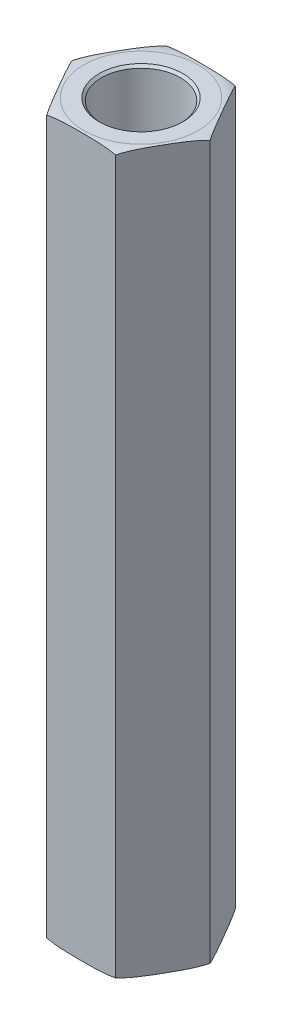
ISO-10303-21;
HEADER;
FILE_DESCRIPTION(('STEP AP214'),'2;1');
FILE_NAME('part.step','',(''),(''),'','','');
FILE_SCHEMA(('AUTOMOTIVE_DESIGN { 1 0 10303 214 1 1 1 1 }'));
ENDSEC;
DATA;
#1=APPLICATION_CONTEXT('core data for automotive mechanical design processes');
#2=APPLICATION_PROTOCOL_DEFINITION('international standard','automotive_design',2000,#1);
#3=PRODUCT_CONTEXT('',#1,'mechanical');
#4=PRODUCT('Part','Part','',(#3));
#5=PRODUCT_RELATED_PRODUCT_CATEGORY('part','',(#4));
#6=PRODUCT_DEFINITION_FORMATION('','',#4);
#7=PRODUCT_DEFINITION_CONTEXT('part definition',#1,'design');
#8=PRODUCT_DEFINITION('design','',#6,#7);
#9=PRODUCT_DEFINITION_SHAPE('','',#8);
#10=(LENGTH_UNIT() NAMED_UNIT(*) SI_UNIT(.MILLI.,.METRE.));
#11=(NAMED_UNIT(*) PLANE_ANGLE_UNIT() SI_UNIT($,.RADIAN.));
#12=(NAMED_UNIT(*) SI_UNIT($,.STERADIAN.) SOLID_ANGLE_UNIT());
#13=UNCERTAINTY_MEASURE_WITH_UNIT(LENGTH_MEASURE(1.E-05),#10,'distance_accuracy_value','');
#14=(GEOMETRIC_REPRESENTATION_CONTEXT(3) GLOBAL_UNCERTAINTY_ASSIGNED_CONTEXT((#13)) GLOBAL_UNIT_ASSIGNED_CONTEXT((#10,
#11,#12)) REPRESENTATION_CONTEXT('',''));
#15=CARTESIAN_POINT('',(0.,0.,0.));
#16=DIRECTION('',(0.,0.,1.));
#17=DIRECTION('',(1.,0.,0.));
#18=AXIS2_PLACEMENT_3D('',#15,#16,#17);
#19=CARTESIAN_POINT('',(0.,6.35,0.));
#20=DIRECTION('',(0.,1.,0.));
#21=DIRECTION('',(0.,0.,1.));
#22=AXIS2_PLACEMENT_3D('',#19,#20,#21);
#23=PLANE('',#22);
#24=CARTESIAN_POINT('',(0.,6.35,0.));
#25=DIRECTION('',(0.,1.,0.));
#26=DIRECTION('',(0.,0.,1.));
#27=AXIS2_PLACEMENT_3D('',#24,#25,#26);
#28=CIRCLE('',#27,2.0955);
#29=CARTESIAN_POINT('',(0.,6.35,2.0955));
#30=VERTEX_POINT('',#29);
#31=EDGE_CURVE('E400',#30,#30,#28,.T.);
#32=ORIENTED_EDGE('',*,*,#31,.T.);
#33=EDGE_LOOP('',(#32));
#34=FACE_BOUND('',#33,.T.);
#35=ADVANCED_FACE('F16',(#34),#23,.T.);
#36=CARTESIAN_POINT('',(0.,-6.35,0.));
#37=DIRECTION('',(0.,-1.,0.));
#38=DIRECTION('',(0.,0.,-1.));
#39=AXIS2_PLACEMENT_3D('',#36,#37,#38);
#40=PLANE('',#39);
#41=CARTESIAN_POINT('',(0.,-6.35,0.));
#42=DIRECTION('',(0.,-1.,0.));
#43=DIRECTION('',(0.,0.,-1.));
#44=AXIS2_PLACEMENT_3D('',#41,#42,#43);
#45=CIRCLE('',#44,2.0955);
#46=CARTESIAN_POINT('',(0.,-6.35,-2.0955));
#47=VERTEX_POINT('',#46);
#48=EDGE_CURVE('E129',#47,#47,#45,.T.);
#49=ORIENTED_EDGE('',*,*,#48,.T.);
#50=EDGE_LOOP('',(#49));
#51=FACE_BOUND('',#50,.T.);
#52=ADVANCED_FACE('F383',(#51),#40,.T.);
#53=CARTESIAN_POINT('',(0.,6.35,0.));
#54=DIRECTION('',(0.,1.,0.));
#55=DIRECTION('',(0.,0.,1.));
#56=AXIS2_PLACEMENT_3D('',#53,#54,#55);
#57=CYLINDRICAL_SURFACE('',#56,2.0955);
#58=CARTESIAN_POINT('',(0.,18.9229999999725,0.));
#59=DIRECTION('',(0.,1.,0.));
#60=DIRECTION('',(0.,0.,1.));
#61=AXIS2_PLACEMENT_3D('',#58,#59,#60);
#62=CIRCLE('',#61,2.09549999999581);
#63=CARTESIAN_POINT('',(0.,18.9229999999725,2.09549999999581));
#64=VERTEX_POINT('',#63);
#65=EDGE_CURVE('E127',#64,#64,#62,.T.);
#66=ORIENTED_EDGE('',*,*,#65,.T.);
#67=EDGE_LOOP('',(#66));
#68=FACE_BOUND('',#67,.T.);
#69=ORIENTED_EDGE('',*,*,#31,.F.);
#70=EDGE_LOOP('',(#69));
#71=FACE_BOUND('',#70,.T.);
#72=ADVANCED_FACE('F375',(#68,#71),#57,.F.);
#73=CARTESIAN_POINT('',(0.,-6.35,0.));
#74=DIRECTION('',(0.,-1.,0.));
#75=DIRECTION('',(0.,0.,-1.));
#76=AXIS2_PLACEMENT_3D('',#73,#74,#75);
#77=CYLINDRICAL_SURFACE('',#76,2.0955);
#78=ORIENTED_EDGE('',*,*,#48,.F.);
#79=EDGE_LOOP('',(#78));
#80=FACE_BOUND('',#79,.T.);
#81=CARTESIAN_POINT('',(0.,-18.9229999999725,0.));
#82=DIRECTION('',(0.,-1.,0.));
#83=DIRECTION('',(0.,0.,-1.));
#84=AXIS2_PLACEMENT_3D('',#81,#82,#83);
#85=CIRCLE('',#84,2.09550000005265);
#86=CARTESIAN_POINT('',(0.,-18.9229999999725,-2.09550000005265));
#87=VERTEX_POINT('',#86);
#88=EDGE_CURVE('E92',#87,#87,#85,.T.);
#89=ORIENTED_EDGE('',*,*,#88,.T.);
#90=EDGE_LOOP('',(#89));
#91=FACE_BOUND('',#90,.T.);
#92=ADVANCED_FACE('F367',(#80,#91),#77,.F.);
#93=CARTESIAN_POINT('',(0.,19.0499999999361,0.));
#94=DIRECTION('',(0.,1.,0.));
#95=DIRECTION('',(0.,0.,1.));
#96=AXIS2_PLACEMENT_3D('',#93,#94,#95);
#97=CONICAL_SURFACE('',#96,2.22249999995938,0.785398163397448);
#98=CARTESIAN_POINT('',(0.,19.0499999999929,0.));
#99=DIRECTION('',(0.,1.,0.));
#100=DIRECTION('',(0.,0.,1.));
#101=AXIS2_PLACEMENT_3D('',#98,#99,#100);
#102=CIRCLE('',#101,2.22250000001623);
#103=CARTESIAN_POINT('',(0.,19.0499999999929,2.22250000001623));
#104=VERTEX_POINT('',#103);
#105=EDGE_CURVE('E204',#104,#104,#102,.T.);
#106=ORIENTED_EDGE('',*,*,#105,.T.);
#107=EDGE_LOOP('',(#106));
#108=FACE_BOUND('',#107,.T.);
#109=ORIENTED_EDGE('',*,*,#65,.F.);
#110=EDGE_LOOP('',(#109));
#111=FACE_BOUND('',#110,.T.);
#112=ADVANCED_FACE('F360',(#108,#111),#97,.F.);
#113=CARTESIAN_POINT('',(0.,-19.0499999999361,0.));
#114=DIRECTION('',(0.,-1.,0.));
#115=DIRECTION('',(0.,0.,-1.));
#116=AXIS2_PLACEMENT_3D('',#113,#114,#115);
#117=CONICAL_SURFACE('',#116,2.22250000001623,0.785398163397448);
#118=ORIENTED_EDGE('',*,*,#88,.F.);
#119=EDGE_LOOP('',(#118));
#120=FACE_BOUND('',#119,.T.);
#121=CARTESIAN_POINT('',(0.,-19.0499999999361,0.));
#122=DIRECTION('',(0.,-1.,0.));
#123=DIRECTION('',(0.,0.,-1.));
#124=AXIS2_PLACEMENT_3D('',#121,#122,#123);
#125=CIRCLE('',#124,2.22250000001623);
#126=CARTESIAN_POINT('',(0.,-19.0499999999361,-2.22250000001623));
#127=VERTEX_POINT('',#126);
#128=EDGE_CURVE('E199',#127,#127,#125,.F.);
#129=ORIENTED_EDGE('',*,*,#128,.F.);
#130=EDGE_LOOP('',(#129));
#131=FACE_BOUND('',#130,.T.);
#132=ADVANCED_FACE('F354',(#120,#131),#117,.F.);
#133=CARTESIAN_POINT('',(1.83308710467706,19.05,3.17499999999999));
#134=DIRECTION('',(-0.866025403784439,0.,-0.5));
#135=DIRECTION('',(-0.5,0.,0.866025403784439));
#136=AXIS2_PLACEMENT_3D('',#133,#134,#135);
#137=PLANE('',#136);
#138=DIRECTION('',(0.,1.,0.));
#139=VECTOR('',#138,1.);
#140=CARTESIAN_POINT('',(3.66617420935412,19.05,0.));
#141=LINE('',#140,#139);
#142=CARTESIAN_POINT('',(3.66617420935412,-18.923,0.));
#143=VERTEX_POINT('',#142);
#144=CARTESIAN_POINT('',(3.66617420935412,18.923,0.));
#145=VERTEX_POINT('',#144);
#146=EDGE_CURVE('E74',#143,#145,#141,.T.);
#147=ORIENTED_EDGE('',*,*,#146,.T.);
#148=CARTESIAN_POINT('',(1.83308710467706,18.923,3.17499999999999));
#149=CARTESIAN_POINT('',(1.87128169935724,18.9389014148997,3.10884502143943));
#150=CARTESIAN_POINT('',(1.90969320538962,18.9524886076105,3.04231434139611));
#151=CARTESIAN_POINT('',(1.98677079607408,18.9758161979402,2.90881203820562));
#152=CARTESIAN_POINT('',(2.02543658353273,18.9855604771397,2.84184092981258));
#153=CARTESIAN_POINT('',(2.10284499535247,19.0019966530451,2.70776562760758));
#154=CARTESIAN_POINT('',(2.14158731769808,19.0086945328669,2.64066195690178));
#155=CARTESIAN_POINT('',(2.21916296783007,19.0197767572932,2.50629698944297));
#156=CARTESIAN_POINT('',(2.2579963181535,19.024160450474,2.43903565365468));
#157=CARTESIAN_POINT('',(2.33572065438806,19.0312403004263,2.30441315431184));
#158=CARTESIAN_POINT('',(2.37461166028646,19.0339355237591,2.23705195613837));
#159=CARTESIAN_POINT('',(2.45240986808529,19.0381531983713,2.10230150749298));
#160=CARTESIAN_POINT('',(2.49131707051153,19.0396756080272,2.03491225611037));
#161=CARTESIAN_POINT('',(2.5687461380425,19.041922705889,1.90080117716405));
#162=CARTESIAN_POINT('',(2.60726795154189,19.0426552468181,1.83407943898342));
#163=CARTESIAN_POINT('',(2.6843135305698,19.0435767302574,1.70063258160851));
#164=CARTESIAN_POINT('',(2.72283729611684,19.0437656658949,1.63390746238215));
#165=CARTESIAN_POINT('',(2.79990166972112,19.0436659966806,1.50042805184608));
#166=CARTESIAN_POINT('',(2.83844227771303,19.0433771811766,1.4336737606495));
#167=CARTESIAN_POINT('',(2.91552223317795,19.042221986219,1.30016736153911));
#168=CARTESIAN_POINT('',(2.9540615806188,19.0413555970386,1.23341525368101));
#169=CARTESIAN_POINT('',(3.03113161773355,19.0387861940656,1.09992603365704));
#170=CARTESIAN_POINT('',(3.06966230777161,19.0370832271617,1.03318892086044));
#171=CARTESIAN_POINT('',(3.14670480062218,19.0324387229726,0.899747408901487));
#172=CARTESIAN_POINT('',(3.18521660427684,19.0294972471358,0.833043008280498));
#173=CARTESIAN_POINT('',(3.24841925163182,19.0232174124749,0.72357281188882));
#174=CARTESIAN_POINT('',(3.27312282066116,19.0203980110463,0.680784975201713));
#175=CARTESIAN_POINT('',(3.32249186130897,19.0138696794304,0.595275288478771));
#176=CARTESIAN_POINT('',(3.34715734368941,19.0101610809139,0.552553419802656));
#177=CARTESIAN_POINT('',(3.39643377591427,19.0016802711497,0.467204135573464));
#178=CARTESIAN_POINT('',(3.42104474295594,18.9969084657008,0.424576690233898));
#179=CARTESIAN_POINT('',(3.47026036719572,18.9860987712516,0.339332728524376));
#180=CARTESIAN_POINT('',(3.49486485317658,18.9800577313084,0.296716508711413));
#181=CARTESIAN_POINT('',(3.54398805502187,18.9665138354161,0.21163262728491));
#182=CARTESIAN_POINT('',(3.56850671785506,18.959010197803,0.169165057524178));
#183=CARTESIAN_POINT('',(3.61743974029948,18.9423203507084,0.0844105764825355));
#184=CARTESIAN_POINT('',(3.64185387349849,18.9331314978033,0.0421240573590955));
#185=CARTESIAN_POINT('',(3.66617420935412,18.923,0.));
#186=B_SPLINE_CURVE_WITH_KNOTS('',3,(#148,#149,#150,#151,#152,#153,#154,#155,#156,#157,#158,
#159,#160,#161,#162,#163,#164,#165,#166,#167,#168,#169,#170,#171,#172,#173,#174,#175,#176,#177,
#178,#179,#180,#181,#182,#183,#184,#185),.UNSPECIFIED.,.F.,.F.,(4,2,2,2,2,2,2,2,2,2,2,2,2,2,2,2,
2,2,4),(0.,0.233977307817955,0.46771767504072,0.700996973557539,0.934341903229802,
1.16781571967246,1.40129782179832,1.63243665809679,1.86357841666627,2.09482211846306,
2.32606971471508,2.55730435147412,2.78852751694429,2.936983692651,3.08538458004484,
3.23372892334592,3.38244598546617,3.53124274626086,3.68027493713584),.UNSPECIFIED.);
#187=CARTESIAN_POINT('',(1.83308710467706,18.923,3.17499999999999));
#188=VERTEX_POINT('',#187);
#189=EDGE_CURVE('E98',#188,#145,#186,.T.);
#190=ORIENTED_EDGE('',*,*,#189,.F.);
#191=DIRECTION('',(0.,1.,0.));
#192=VECTOR('',#191,1.);
#193=CARTESIAN_POINT('',(1.83308710467707,19.05,3.17499999999999));
#194=LINE('',#193,#192);
#195=CARTESIAN_POINT('',(1.83308710467706,-18.923,3.17499999999999));
#196=VERTEX_POINT('',#195);
#197=EDGE_CURVE('E91',#188,#196,#194,.F.);
#198=ORIENTED_EDGE('',*,*,#197,.T.);
#199=CARTESIAN_POINT('',(3.66617420935412,-18.923,0.));
#200=CARTESIAN_POINT('',(3.62797961467394,-18.9389014148997,0.0661549785605664));
#201=CARTESIAN_POINT('',(3.58956810864156,-18.9524886076105,0.132685658603887));
#202=CARTESIAN_POINT('',(3.5124905179571,-18.9758161979402,0.266187961794378));
#203=CARTESIAN_POINT('',(3.47382473049845,-18.9855604771397,0.333159070187413));
#204=CARTESIAN_POINT('',(3.39641631867871,-19.0019966530451,0.467234372392412));
#205=CARTESIAN_POINT('',(3.3576739963331,-19.0086945328669,0.53433804309822));
#206=CARTESIAN_POINT('',(3.28009834620111,-19.0197767572932,0.668703010557026));
#207=CARTESIAN_POINT('',(3.24126499587768,-19.024160450474,0.735964346345317));
#208=CARTESIAN_POINT('',(3.16354065964312,-19.0312403004263,0.870586845688155));
#209=CARTESIAN_POINT('',(3.12464965374472,-19.0339355237591,0.937948043861631));
#210=CARTESIAN_POINT('',(3.04685144594589,-19.0381531983713,1.07269849250702));
#211=CARTESIAN_POINT('',(3.00794424351965,-19.0396756080272,1.14008774388963));
#212=CARTESIAN_POINT('',(2.93051517598868,-19.041922705889,1.27419882283594));
#213=CARTESIAN_POINT('',(2.89199336248929,-19.0426552468181,1.34092056101658));
#214=CARTESIAN_POINT('',(2.81494778346138,-19.0435767302574,1.47436741839149));
#215=CARTESIAN_POINT('',(2.77642401791434,-19.0437656658949,1.54109253761784));
#216=CARTESIAN_POINT('',(2.69935964431006,-19.0436659966806,1.67457194815391));
#217=CARTESIAN_POINT('',(2.66081903631815,-19.0433771811766,1.7413262393505));
#218=CARTESIAN_POINT('',(2.58373908085323,-19.042221986219,1.87483263846089));
#219=CARTESIAN_POINT('',(2.54519973341238,-19.0413555970386,1.94158474631899));
#220=CARTESIAN_POINT('',(2.46812969629763,-19.0387861940656,2.07507396634296));
#221=CARTESIAN_POINT('',(2.42959900625957,-19.0370832271617,2.14181107913956));
#222=CARTESIAN_POINT('',(2.352556513409,-19.0324387229726,2.27525259109851));
#223=CARTESIAN_POINT('',(2.31404470975434,-19.0294972471358,2.3419569917195));
#224=CARTESIAN_POINT('',(2.25084206239936,-19.0232174124749,2.45142718811118));
#225=CARTESIAN_POINT('',(2.22613849337002,-19.0203980110463,2.49421502479828));
#226=CARTESIAN_POINT('',(2.17676945272221,-19.0138696794304,2.57972471152123));
#227=CARTESIAN_POINT('',(2.15210397034177,-19.0101610809139,2.62244658019734));
#228=CARTESIAN_POINT('',(2.10282753811691,-19.0016802711497,2.70779586442653));
#229=CARTESIAN_POINT('',(2.07821657107524,-18.9969084657008,2.7504233097661));
#230=CARTESIAN_POINT('',(2.02900094683546,-18.9860987712516,2.83566727147562));
#231=CARTESIAN_POINT('',(2.0043964608546,-18.9800577313084,2.87828349128858));
#232=CARTESIAN_POINT('',(1.95527325900931,-18.9665138354161,2.96336737271509));
#233=CARTESIAN_POINT('',(1.93075459617612,-18.959010197803,3.00583494247582));
#234=CARTESIAN_POINT('',(1.88182157373171,-18.9423203507084,3.09058942351746));
#235=CARTESIAN_POINT('',(1.8574074405327,-18.9331314978033,3.1328759426409));
#236=CARTESIAN_POINT('',(1.83308710467706,-18.923,3.17499999999999));
#237=B_SPLINE_CURVE_WITH_KNOTS('',3,(#199,#200,#201,#202,#203,#204,#205,#206,#207,#208,#209,
#210,#211,#212,#213,#214,#215,#216,#217,#218,#219,#220,#221,#222,#223,#224,#225,#226,#227,#228,
#229,#230,#231,#232,#233,#234,#235,#236),.UNSPECIFIED.,.F.,.F.,(4,2,2,2,2,2,2,2,2,2,2,2,2,2,2,2,
2,2,4),(0.,0.233977307817955,0.46771767504072,0.70099697355754,0.934341903229803,
1.16781571967246,1.40129782179833,1.63243665809679,1.86357841666628,2.09482211846306,
2.32606971471508,2.55730435147412,2.78852751694429,2.93698369265101,3.08538458004484,
3.23372892334592,3.38244598546617,3.53124274626086,3.68027493713584),.UNSPECIFIED.);
#238=EDGE_CURVE('E85',#143,#196,#237,.T.);
#239=ORIENTED_EDGE('',*,*,#238,.F.);
#240=EDGE_LOOP('',(#147,#190,#198,#239));
#241=FACE_BOUND('',#240,.T.);
#242=ADVANCED_FACE('F89',(#241),#137,.F.);
#243=CARTESIAN_POINT('',(3.66617420935412,19.05,0.));
#244=DIRECTION('',(-0.866025403784439,0.,0.5));
#245=DIRECTION('',(0.5,0.,0.866025403784439));
#246=AXIS2_PLACEMENT_3D('',#243,#244,#245);
#247=PLANE('',#246);
#248=DIRECTION('',(0.,1.,0.));
#249=VECTOR('',#248,1.);
#250=CARTESIAN_POINT('',(1.83308710467706,19.05,-3.175));
#251=LINE('',#250,#249);
#252=CARTESIAN_POINT('',(1.83308710467706,-18.923,-3.175));
#253=VERTEX_POINT('',#252);
#254=CARTESIAN_POINT('',(1.83308710467705,18.923,-3.175));
#255=VERTEX_POINT('',#254);
#256=EDGE_CURVE('E163',#253,#255,#251,.T.);
#257=ORIENTED_EDGE('',*,*,#256,.T.);
#258=CARTESIAN_POINT('',(3.66617420935412,18.923,0.));
#259=CARTESIAN_POINT('',(3.62797961467394,18.9389014148997,-0.0661549785605604));
#260=CARTESIAN_POINT('',(3.58956810864156,18.9524886076105,-0.132685658603881));
#261=CARTESIAN_POINT('',(3.5124905179571,18.9758161979402,-0.266187961794372));
#262=CARTESIAN_POINT('',(3.47382473049845,18.9855604771397,-0.333159070187407));
#263=CARTESIAN_POINT('',(3.39641631867872,19.0019966530451,-0.467234372392405));
#264=CARTESIAN_POINT('',(3.35767399633311,19.0086945328669,-0.534338043098212));
#265=CARTESIAN_POINT('',(3.28009834620111,19.0197767572932,-0.668703010557018));
#266=CARTESIAN_POINT('',(3.24126499587769,19.024160450474,-0.735964346345308));
#267=CARTESIAN_POINT('',(3.16354065964312,19.0312403004263,-0.870586845688146));
#268=CARTESIAN_POINT('',(3.12464965374473,19.0339355237591,-0.937948043861621));
#269=CARTESIAN_POINT('',(3.04685144594589,19.0381531983713,-1.07269849250701));
#270=CARTESIAN_POINT('',(3.00794424351965,19.0396756080272,-1.14008774388962));
#271=CARTESIAN_POINT('',(2.93051517598869,19.041922705889,-1.27419882283593));
#272=CARTESIAN_POINT('',(2.8919933624893,19.0426552468181,-1.34092056101657));
#273=CARTESIAN_POINT('',(2.81494778346139,19.0435767302574,-1.47436741839148));
#274=CARTESIAN_POINT('',(2.77642401791434,19.0437656658949,-1.54109253761783));
#275=CARTESIAN_POINT('',(2.69935964431007,19.0436659966806,-1.6745719481539));
#276=CARTESIAN_POINT('',(2.66081903631816,19.0433771811766,-1.74132623935049));
#277=CARTESIAN_POINT('',(2.58373908085323,19.042221986219,-1.87483263846088));
#278=CARTESIAN_POINT('',(2.54519973341239,19.0413555970386,-1.94158474631897));
#279=CARTESIAN_POINT('',(2.46812969629764,19.0387861940656,-2.07507396634294));
#280=CARTESIAN_POINT('',(2.42959900625958,19.0370832271617,-2.14181107913955));
#281=CARTESIAN_POINT('',(2.35255651340901,19.0324387229726,-2.27525259109849));
#282=CARTESIAN_POINT('',(2.31404470975435,19.0294972471358,-2.34195699171948));
#283=CARTESIAN_POINT('',(2.25084206239937,19.0232174124749,-2.45142718811116));
#284=CARTESIAN_POINT('',(2.22613849337003,19.0203980110463,-2.49421502479827));
#285=CARTESIAN_POINT('',(2.17676945272222,19.0138696794304,-2.57972471152122));
#286=CARTESIAN_POINT('',(2.15210397034178,19.0101610809139,-2.62244658019733));
#287=CARTESIAN_POINT('',(2.10282753811691,19.0016802711497,-2.70779586442653));
#288=CARTESIAN_POINT('',(2.07821657107524,18.9969084657008,-2.75042330976609));
#289=CARTESIAN_POINT('',(2.02900094683546,18.9860987712516,-2.83566727147562));
#290=CARTESIAN_POINT('',(2.0043964608546,18.9800577313084,-2.87828349128858));
#291=CARTESIAN_POINT('',(1.95527325900931,18.9665138354161,-2.96336737271509));
#292=CARTESIAN_POINT('',(1.93075459617612,18.959010197803,-3.00583494247582));
#293=CARTESIAN_POINT('',(1.8818215737317,18.9423203507084,-3.09058942351747));
#294=CARTESIAN_POINT('',(1.85740744053269,18.9331314978033,-3.13287594264091));
#295=CARTESIAN_POINT('',(1.83308710467705,18.923,-3.175));
#296=B_SPLINE_CURVE_WITH_KNOTS('',3,(#258,#259,#260,#261,#262,#263,#264,#265,#266,#267,#268,
#269,#270,#271,#272,#273,#274,#275,#276,#277,#278,#279,#280,#281,#282,#283,#284,#285,#286,#287,
#288,#289,#290,#291,#292,#293,#294,#295),.UNSPECIFIED.,.F.,.F.,(4,2,2,2,2,2,2,2,2,2,2,2,2,2,2,2,
2,2,4),(0.,0.233977307817954,0.467717675040719,0.700996973557537,0.934341903229799,
1.16781571967246,1.40129782179832,1.63243665809678,1.86357841666627,2.09482211846305,
2.32606971471507,2.55730435147411,2.78852751694428,2.936983692651,3.08538458004484,
3.23372892334592,3.38244598546618,3.53124274626087,3.68027493713586),.UNSPECIFIED.);
#297=EDGE_CURVE('E82',#145,#255,#296,.T.);
#298=ORIENTED_EDGE('',*,*,#297,.F.);
#299=ORIENTED_EDGE('',*,*,#146,.F.);
#300=CARTESIAN_POINT('',(1.83308710467706,-18.923,-3.175));
#301=CARTESIAN_POINT('',(1.87128169935723,-18.9389014148997,-3.10884502143944));
#302=CARTESIAN_POINT('',(1.90969320538961,-18.9524886076105,-3.04231434139612));
#303=CARTESIAN_POINT('',(1.98677079607408,-18.9758161979402,-2.90881203820563));
#304=CARTESIAN_POINT('',(2.02543658353272,-18.9855604771397,-2.84184092981259));
#305=CARTESIAN_POINT('',(2.10284499535246,-19.0019966530451,-2.70776562760759));
#306=CARTESIAN_POINT('',(2.14158731769807,-19.0086945328669,-2.64066195690179));
#307=CARTESIAN_POINT('',(2.21916296783006,-19.0197767572932,-2.50629698944298));
#308=CARTESIAN_POINT('',(2.25799631815349,-19.024160450474,-2.43903565365469));
#309=CARTESIAN_POINT('',(2.33572065438805,-19.0312403004263,-2.30441315431186));
#310=CARTESIAN_POINT('',(2.37461166028645,-19.0339355237591,-2.23705195613838));
#311=CARTESIAN_POINT('',(2.45240986808528,-19.0381531983713,-2.102301507493));
#312=CARTESIAN_POINT('',(2.49131707051152,-19.0396756080272,-2.03491225611039));
#313=CARTESIAN_POINT('',(2.56874613804248,-19.041922705889,-1.90080117716407));
#314=CARTESIAN_POINT('',(2.60726795154187,-19.0426552468181,-1.83407943898344));
#315=CARTESIAN_POINT('',(2.68431353056979,-19.0435767302574,-1.70063258160853));
#316=CARTESIAN_POINT('',(2.72283729611683,-19.0437656658949,-1.63390746238217));
#317=CARTESIAN_POINT('',(2.7999016697211,-19.0436659966806,-1.50042805184611));
#318=CARTESIAN_POINT('',(2.83844227771302,-19.0433771811766,-1.43367376064952));
#319=CARTESIAN_POINT('',(2.91552223317794,-19.042221986219,-1.30016736153913));
#320=CARTESIAN_POINT('',(2.95406158061878,-19.0413555970386,-1.23341525368103));
#321=CARTESIAN_POINT('',(3.03113161773353,-19.0387861940656,-1.09992603365707));
#322=CARTESIAN_POINT('',(3.06966230777159,-19.0370832271617,-1.03318892086046));
#323=CARTESIAN_POINT('',(3.14670480062216,-19.0324387229726,-0.899747408901513));
#324=CARTESIAN_POINT('',(3.18521660427682,-19.0294972471358,-0.833043008280524));
#325=CARTESIAN_POINT('',(3.2484192516318,-19.0232174124749,-0.723572811888844));
#326=CARTESIAN_POINT('',(3.27312282066114,-19.0203980110463,-0.680784975201736));
#327=CARTESIAN_POINT('',(3.32249186130896,-19.0138696794304,-0.59527528847879));
#328=CARTESIAN_POINT('',(3.3471573436894,-19.0101610809139,-0.552553419802673));
#329=CARTESIAN_POINT('',(3.39643377591426,-19.0016802711497,-0.467204135573478));
#330=CARTESIAN_POINT('',(3.42104474295593,-18.9969084657008,-0.42457669023391));
#331=CARTESIAN_POINT('',(3.47026036719571,-18.9860987712516,-0.339332728524384));
#332=CARTESIAN_POINT('',(3.49486485317657,-18.9800577313084,-0.29671650871142));
#333=CARTESIAN_POINT('',(3.54398805502186,-18.9665138354161,-0.211632627284913));
#334=CARTESIAN_POINT('',(3.56850671785505,-18.959010197803,-0.169165057524178));
#335=CARTESIAN_POINT('',(3.61743974029948,-18.9423203507084,-0.0844105764825321));
#336=CARTESIAN_POINT('',(3.64185387349849,-18.9331314978033,-0.0421240573590899));
#337=CARTESIAN_POINT('',(3.66617420935412,-18.923,0.));
#338=B_SPLINE_CURVE_WITH_KNOTS('',3,(#300,#301,#302,#303,#304,#305,#306,#307,#308,#309,#310,
#311,#312,#313,#314,#315,#316,#317,#318,#319,#320,#321,#322,#323,#324,#325,#326,#327,#328,#329,
#330,#331,#332,#333,#334,#335,#336,#337),.UNSPECIFIED.,.F.,.F.,(4,2,2,2,2,2,2,2,2,2,2,2,2,2,2,2,
2,2,4),(0.,0.233977307817952,0.467717675040715,0.700996973557533,0.934341903229794,
1.16781571967245,1.40129782179831,1.63243665809677,1.86357841666626,2.09482211846304,
2.32606971471506,2.5573043514741,2.78852751694426,2.93698369265099,3.08538458004483,
3.23372892334591,3.38244598546617,3.53124274626087,3.68027493713585),.UNSPECIFIED.);
#339=EDGE_CURVE('E79',#253,#143,#338,.T.);
#340=ORIENTED_EDGE('',*,*,#339,.F.);
#341=EDGE_LOOP('',(#257,#298,#299,#340));
#342=FACE_BOUND('',#341,.T.);
#343=ADVANCED_FACE('F77',(#342),#247,.F.);
#344=CARTESIAN_POINT('',(-1.83308710467707,19.05,-3.175));
#345=DIRECTION('',(0.,-1.,0.));
#346=DIRECTION('',(0.,0.,-1.));
#347=AXIS2_PLACEMENT_3D('',#344,#345,#346);
#348=PLANE('',#347);
#349=CARTESIAN_POINT('',(0.,19.05,0.));
#350=DIRECTION('',(0.,-1.,0.));
#351=DIRECTION('',(0.,0.,1.));
#352=AXIS2_PLACEMENT_3D('',#349,#350,#351);
#353=CIRCLE('',#352,3.03117420935412);
#354=CARTESIAN_POINT('',(0.,19.05,3.03117420935412));
#355=VERTEX_POINT('',#354);
#356=CARTESIAN_POINT('',(0.,19.05,-3.03117420935412));
#357=VERTEX_POINT('',#356);
#358=EDGE_CURVE('E240',#355,#357,#353,.T.);
#359=ORIENTED_EDGE('',*,*,#358,.F.);
#360=CARTESIAN_POINT('',(0.,19.05,0.));
#361=DIRECTION('',(0.,-1.,0.));
#362=DIRECTION('',(0.,0.,-1.));
#363=AXIS2_PLACEMENT_3D('',#360,#361,#362);
#364=CIRCLE('',#363,3.03117420935412);
#365=EDGE_CURVE('E203',#357,#355,#364,.T.);
#366=ORIENTED_EDGE('',*,*,#365,.F.);
#367=EDGE_LOOP('',(#359,#366));
#368=FACE_BOUND('',#367,.T.);
#369=ORIENTED_EDGE('',*,*,#105,.F.);
#370=EDGE_LOOP('',(#369));
#371=FACE_BOUND('',#370,.T.);
#372=ADVANCED_FACE('F211',(#368,#371),#348,.F.);
#373=CARTESIAN_POINT('',(-1.83308710467707,-19.05,-3.175));
#374=DIRECTION('',(0.,-1.,0.));
#375=DIRECTION('',(0.,0.,-1.));
#376=AXIS2_PLACEMENT_3D('',#373,#374,#375);
#377=PLANE('',#376);
#378=CARTESIAN_POINT('',(0.,-19.05,0.));
#379=DIRECTION('',(0.,1.,0.));
#380=DIRECTION('',(0.,0.,1.));
#381=AXIS2_PLACEMENT_3D('',#378,#379,#380);
#382=CIRCLE('',#381,3.03117420935412);
#383=CARTESIAN_POINT('',(0.,-19.05,-3.03117420935412));
#384=VERTEX_POINT('',#383);
#385=CARTESIAN_POINT('',(0.,-19.05,3.03117420935412));
#386=VERTEX_POINT('',#385);
#387=EDGE_CURVE('E202',#384,#386,#382,.F.);
#388=ORIENTED_EDGE('',*,*,#387,.T.);
#389=CARTESIAN_POINT('',(0.,-19.05,0.));
#390=DIRECTION('',(0.,1.,0.));
#391=DIRECTION('',(0.,0.,-1.));
#392=AXIS2_PLACEMENT_3D('',#389,#390,#391);
#393=CIRCLE('',#392,3.03117420935412);
#394=EDGE_CURVE('E267',#384,#386,#393,.T.);
#395=ORIENTED_EDGE('',*,*,#394,.F.);
#396=EDGE_LOOP('',(#388,#395));
#397=FACE_BOUND('',#396,.T.);
#398=ORIENTED_EDGE('',*,*,#128,.T.);
#399=EDGE_LOOP('',(#398));
#400=FACE_BOUND('',#399,.T.);
#401=ADVANCED_FACE('F217',(#397,#400),#377,.T.);
#402=CARTESIAN_POINT('',(-1.83308710467707,19.05,3.175));
#403=DIRECTION('',(0.,0.,-1.));
#404=DIRECTION('',(-1.,0.,0.));
#405=AXIS2_PLACEMENT_3D('',#402,#403,#404);
#406=PLANE('',#405);
#407=ORIENTED_EDGE('',*,*,#197,.F.);
#408=CARTESIAN_POINT('',(-1.83308710467706,18.923,3.175));
#409=CARTESIAN_POINT('',(-1.73237579828683,18.9439400141518,3.175));
#410=CARTESIAN_POINT('',(-1.63096506893486,18.9608853495327,3.175));
#411=CARTESIAN_POINT('',(-1.42767146651469,18.9884971643984,3.175));
#412=CARTESIAN_POINT('',(-1.32579191427254,18.9991875658753,3.175));
#413=CARTESIAN_POINT('',(-1.12177634709138,19.0161280408079,3.175));
#414=CARTESIAN_POINT('',(-1.0196405664338,19.0223812707189,3.175));
#415=CARTESIAN_POINT('',(-0.815663681397376,19.0319028064183,3.175));
#416=CARTESIAN_POINT('',(-0.713823115514574,19.0351834044999,3.175));
#417=CARTESIAN_POINT('',(-0.510018485441651,19.0399454848703,3.175));
#418=CARTESIAN_POINT('',(-0.408054390577977,19.0414254100882,3.175));
#419=CARTESIAN_POINT('',(-0.20406020033787,19.0433146818379,3.175));
#420=CARTESIAN_POINT('',(-0.102030100168935,19.0437234241492,3.175));
#421=CARTESIAN_POINT('',(0.102030100168936,19.0437234241492,3.175));
#422=CARTESIAN_POINT('',(0.204060200337871,19.0433146818379,3.17499999999999));
#423=CARTESIAN_POINT('',(0.408054390577978,19.0414254100882,3.17499999999999));
#424=CARTESIAN_POINT('',(0.510018485441653,19.0399454848703,3.17499999999999));
#425=CARTESIAN_POINT('',(0.713823115514576,19.0351834044999,3.17499999999999));
#426=CARTESIAN_POINT('',(0.815663681397379,19.0319028064183,3.17499999999999));
#427=CARTESIAN_POINT('',(1.0196405664338,19.0223812707189,3.17499999999999));
#428=CARTESIAN_POINT('',(1.12177634709138,19.0161280408079,3.17499999999999));
#429=CARTESIAN_POINT('',(1.32579191427255,18.9991875658753,3.17499999999999));
#430=CARTESIAN_POINT('',(1.4276714665147,18.9884971643984,3.17499999999999));
#431=CARTESIAN_POINT('',(1.63096506893487,18.9608853495327,3.17499999999999));
#432=CARTESIAN_POINT('',(1.73237579828684,18.9439400141518,3.17499999999999));
#433=CARTESIAN_POINT('',(1.83308710467707,18.923,3.17499999999999));
#434=B_SPLINE_CURVE_WITH_KNOTS('',3,(#408,#409,#410,#411,#412,#413,#414,#415,#416,#417,#418,
#419,#420,#421,#422,#423,#424,#425,#426,#427,#428,#429,#430,#431,#432,#433),.UNSPECIFIED.,.F.,
.F.,(4,2,2,2,2,2,2,2,2,2,2,2,4),(0.,0.308333242342808,0.615479423308235,0.92240689113001,
1.2280592962085,1.53397581645216,1.84006485747889,2.14615389850562,2.45207041874928,
2.75772282382777,3.06465029164955,3.37179647261498,3.68012971495778),.UNSPECIFIED.);
#435=CARTESIAN_POINT('',(-1.83308710467706,18.923,3.175));
#436=VERTEX_POINT('',#435);
#437=EDGE_CURVE('E189',#436,#188,#434,.T.);
#438=ORIENTED_EDGE('',*,*,#437,.F.);
#439=DIRECTION('',(0.,1.,0.));
#440=VECTOR('',#439,1.);
#441=CARTESIAN_POINT('',(-1.83308710467707,19.05,3.175));
#442=LINE('',#441,#440);
#443=CARTESIAN_POINT('',(-1.83308710467708,-18.923,3.17499999999999));
#444=VERTEX_POINT('',#443);
#445=EDGE_CURVE('E157',#436,#444,#442,.F.);
#446=ORIENTED_EDGE('',*,*,#445,.T.);
#447=CARTESIAN_POINT('',(1.83308710467706,-18.923,3.17499999999999));
#448=CARTESIAN_POINT('',(1.73237579828684,-18.9439400141518,3.17499999999999));
#449=CARTESIAN_POINT('',(1.63096506893486,-18.9608853495327,3.17499999999999));
#450=CARTESIAN_POINT('',(1.4276714665147,-18.9884971643984,3.17499999999999));
#451=CARTESIAN_POINT('',(1.32579191427254,-18.9991875658753,3.17499999999999));
#452=CARTESIAN_POINT('',(1.12177634709138,-19.0161280408079,3.17499999999999));
#453=CARTESIAN_POINT('',(1.0196405664338,-19.0223812707189,3.17499999999999));
#454=CARTESIAN_POINT('',(0.815663681397379,-19.0319028064183,3.17499999999999));
#455=CARTESIAN_POINT('',(0.713823115514576,-19.0351834044999,3.17499999999999));
#456=CARTESIAN_POINT('',(0.510018485441653,-19.0399454848703,3.17499999999999));
#457=CARTESIAN_POINT('',(0.408054390577978,-19.0414254100882,3.17499999999999));
#458=CARTESIAN_POINT('',(0.204060200337871,-19.0433146818379,3.17499999999999));
#459=CARTESIAN_POINT('',(0.102030100168935,-19.0437234241492,3.175));
#460=CARTESIAN_POINT('',(-0.102030100168936,-19.0437234241492,3.175));
#461=CARTESIAN_POINT('',(-0.204060200337872,-19.0433146818379,3.175));
#462=CARTESIAN_POINT('',(-0.408054390577981,-19.0414254100882,3.175));
#463=CARTESIAN_POINT('',(-0.510018485441656,-19.0399454848703,3.175));
#464=CARTESIAN_POINT('',(-0.713823115514581,-19.0351834044999,3.175));
#465=CARTESIAN_POINT('',(-0.815663681397384,-19.0319028064183,3.175));
#466=CARTESIAN_POINT('',(-1.01964056643381,-19.0223812707189,3.175));
#467=CARTESIAN_POINT('',(-1.12177634709139,-19.0161280408079,3.175));
#468=CARTESIAN_POINT('',(-1.32579191427255,-18.9991875658753,3.175));
#469=CARTESIAN_POINT('',(-1.42767146651471,-18.9884971643984,3.175));
#470=CARTESIAN_POINT('',(-1.63096506893487,-18.9608853495327,3.175));
#471=CARTESIAN_POINT('',(-1.73237579828685,-18.9439400141518,3.175));
#472=CARTESIAN_POINT('',(-1.83308710467708,-18.923,3.175));
#473=B_SPLINE_CURVE_WITH_KNOTS('',3,(#447,#448,#449,#450,#451,#452,#453,#454,#455,#456,#457,
#458,#459,#460,#461,#462,#463,#464,#465,#466,#467,#468,#469,#470,#471,#472),.UNSPECIFIED.,.F.,
.F.,(4,2,2,2,2,2,2,2,2,2,2,2,4),(0.,0.308333242342808,0.615479423308237,0.922406891130012,
1.22805929620851,1.53397581645217,1.84006485747889,2.14615389850562,2.45207041874929,
2.75772282382778,3.06465029164956,3.37179647261499,3.6801297149578),.UNSPECIFIED.);
#474=EDGE_CURVE('E250',#196,#444,#473,.T.);
#475=ORIENTED_EDGE('',*,*,#474,.F.);
#476=EDGE_LOOP('',(#407,#438,#446,#475));
#477=FACE_BOUND('',#476,.T.);
#478=ADVANCED_FACE('F249',(#477),#406,.F.);
#479=CARTESIAN_POINT('',(1.83308710467706,19.05,-3.175));
#480=DIRECTION('',(0.,0.,1.));
#481=DIRECTION('',(1.,0.,0.));
#482=AXIS2_PLACEMENT_3D('',#479,#480,#481);
#483=PLANE('',#482);
#484=DIRECTION('',(0.,1.,0.));
#485=VECTOR('',#484,1.);
#486=CARTESIAN_POINT('',(-1.83308710467708,19.05,-3.17499999999999));
#487=LINE('',#486,#485);
#488=CARTESIAN_POINT('',(-1.83308710467708,-18.923,-3.175));
#489=VERTEX_POINT('',#488);
#490=CARTESIAN_POINT('',(-1.83308710467706,18.923,-3.17500000000001));
#491=VERTEX_POINT('',#490);
#492=EDGE_CURVE('E155',#489,#491,#487,.T.);
#493=ORIENTED_EDGE('',*,*,#492,.T.);
#494=CARTESIAN_POINT('',(1.83308710467705,18.923,-3.175));
#495=CARTESIAN_POINT('',(1.73237579828683,18.9439400141518,-3.175));
#496=CARTESIAN_POINT('',(1.63096506893486,18.9608853495327,-3.175));
#497=CARTESIAN_POINT('',(1.42767146651469,18.9884971643984,-3.175));
#498=CARTESIAN_POINT('',(1.32579191427254,18.9991875658753,-3.175));
#499=CARTESIAN_POINT('',(1.12177634709137,19.0161280408079,-3.175));
#500=CARTESIAN_POINT('',(1.01964056643379,19.0223812707189,-3.175));
#501=CARTESIAN_POINT('',(0.815663681397374,19.0319028064183,-3.175));
#502=CARTESIAN_POINT('',(0.713823115514572,19.0351834044999,-3.175));
#503=CARTESIAN_POINT('',(0.51001848544165,19.0399454848703,-3.175));
#504=CARTESIAN_POINT('',(0.408054390577976,19.0414254100882,-3.175));
#505=CARTESIAN_POINT('',(0.20406020033787,19.0433146818379,-3.175));
#506=CARTESIAN_POINT('',(0.102030100168935,19.0437234241492,-3.175));
#507=CARTESIAN_POINT('',(-0.102030100168934,19.0437234241492,-3.175));
#508=CARTESIAN_POINT('',(-0.204060200337869,19.0433146818379,-3.175));
#509=CARTESIAN_POINT('',(-0.408054390577975,19.0414254100882,-3.175));
#510=CARTESIAN_POINT('',(-0.510018485441649,19.0399454848703,-3.175));
#511=CARTESIAN_POINT('',(-0.71382311551457,19.0351834044999,-3.175));
#512=CARTESIAN_POINT('',(-0.815663681397373,19.0319028064183,-3.175));
#513=CARTESIAN_POINT('',(-1.01964056643379,19.0223812707189,-3.175));
#514=CARTESIAN_POINT('',(-1.12177634709137,19.0161280408079,-3.175));
#515=CARTESIAN_POINT('',(-1.32579191427254,18.9991875658753,-3.175));
#516=CARTESIAN_POINT('',(-1.42767146651469,18.9884971643984,-3.175));
#517=CARTESIAN_POINT('',(-1.63096506893485,18.9608853495327,-3.175));
#518=CARTESIAN_POINT('',(-1.73237579828683,18.9439400141518,-3.175));
#519=CARTESIAN_POINT('',(-1.83308710467705,18.923,-3.175));
#520=B_SPLINE_CURVE_WITH_KNOTS('',3,(#494,#495,#496,#497,#498,#499,#500,#501,#502,#503,#504,
#505,#506,#507,#508,#509,#510,#511,#512,#513,#514,#515,#516,#517,#518,#519),.UNSPECIFIED.,.F.,
.F.,(4,2,2,2,2,2,2,2,2,2,2,2,4),(0.,0.308333242342807,0.615479423308234,0.922406891130008,
1.2280592962085,1.53397581645216,1.84006485747888,2.14615389850561,2.45207041874927,
2.75772282382776,3.06465029164953,3.37179647261496,3.68012971495777),.UNSPECIFIED.);
#521=EDGE_CURVE('E194',#255,#491,#520,.T.);
#522=ORIENTED_EDGE('',*,*,#521,.F.);
#523=ORIENTED_EDGE('',*,*,#256,.F.);
#524=CARTESIAN_POINT('',(-1.83308710467708,-18.923,-3.17500000000001));
#525=CARTESIAN_POINT('',(-1.73237579828685,-18.9439400141518,-3.175));
#526=CARTESIAN_POINT('',(-1.63096506893487,-18.9608853495327,-3.175));
#527=CARTESIAN_POINT('',(-1.4276714665147,-18.9884971643984,-3.175));
#528=CARTESIAN_POINT('',(-1.32579191427255,-18.9991875658753,-3.175));
#529=CARTESIAN_POINT('',(-1.12177634709139,-19.0161280408079,-3.175));
#530=CARTESIAN_POINT('',(-1.01964056643381,-19.0223812707189,-3.175));
#531=CARTESIAN_POINT('',(-0.815663681397384,-19.0319028064183,-3.175));
#532=CARTESIAN_POINT('',(-0.71382311551458,-19.0351834044999,-3.175));
#533=CARTESIAN_POINT('',(-0.510018485441656,-19.0399454848703,-3.175));
#534=CARTESIAN_POINT('',(-0.408054390577981,-19.0414254100882,-3.175));
#535=CARTESIAN_POINT('',(-0.204060200337873,-19.0433146818379,-3.175));
#536=CARTESIAN_POINT('',(-0.102030100168937,-19.0437234241492,-3.175));
#537=CARTESIAN_POINT('',(0.102030100168935,-19.0437234241492,-3.175));
#538=CARTESIAN_POINT('',(0.20406020033787,-19.0433146818379,-3.175));
#539=CARTESIAN_POINT('',(0.408054390577977,-19.0414254100882,-3.175));
#540=CARTESIAN_POINT('',(0.510018485441651,-19.0399454848703,-3.175));
#541=CARTESIAN_POINT('',(0.713823115514573,-19.0351834044999,-3.175));
#542=CARTESIAN_POINT('',(0.815663681397376,-19.0319028064183,-3.175));
#543=CARTESIAN_POINT('',(1.0196405664338,-19.0223812707189,-3.175));
#544=CARTESIAN_POINT('',(1.12177634709138,-19.0161280408079,-3.175));
#545=CARTESIAN_POINT('',(1.32579191427254,-18.9991875658753,-3.175));
#546=CARTESIAN_POINT('',(1.42767146651469,-18.9884971643984,-3.175));
#547=CARTESIAN_POINT('',(1.63096506893486,-18.9608853495327,-3.175));
#548=CARTESIAN_POINT('',(1.73237579828683,-18.9439400141518,-3.175));
#549=CARTESIAN_POINT('',(1.83308710467706,-18.923,-3.17500000000001));
#550=B_SPLINE_CURVE_WITH_KNOTS('',3,(#524,#525,#526,#527,#528,#529,#530,#531,#532,#533,#534,
#535,#536,#537,#538,#539,#540,#541,#542,#543,#544,#545,#546,#547,#548,#549),.UNSPECIFIED.,.F.,
.F.,(4,2,2,2,2,2,2,2,2,2,2,2,4),(0.,0.30833324234281,0.615479423308241,0.922406891130018,
1.22805929620851,1.53397581645217,1.84006485747891,2.14615389850563,2.45207041874929,
2.75772282382779,3.06465029164956,3.37179647261499,3.6801297149578),.UNSPECIFIED.);
#551=EDGE_CURVE('E97',#489,#253,#550,.T.);
#552=ORIENTED_EDGE('',*,*,#551,.F.);
#553=EDGE_LOOP('',(#493,#522,#523,#552));
#554=FACE_BOUND('',#553,.T.);
#555=ADVANCED_FACE('F169',(#554),#483,.F.);
#556=CARTESIAN_POINT('',(0.,17.399,0.));
#557=DIRECTION('',(0.,1.,0.));
#558=DIRECTION('',(0.,0.,1.));
#559=AXIS2_PLACEMENT_3D('',#556,#557,#558);
#560=TOROIDAL_SURFACE('',#559,3.03117420935412,1.65100000000002);
#561=ORIENTED_EDGE('',*,*,#358,.T.);
#562=ORIENTED_EDGE('',*,*,#365,.T.);
#563=EDGE_LOOP('',(#561,#562));
#564=FACE_BOUND('',#563,.T.);
#565=ORIENTED_EDGE('',*,*,#437,.T.);
#566=ORIENTED_EDGE('',*,*,#189,.T.);
#567=ORIENTED_EDGE('',*,*,#297,.T.);
#568=ORIENTED_EDGE('',*,*,#521,.T.);
#569=CARTESIAN_POINT('',(-1.83308710467706,18.923,-3.17500000000001));
#570=CARTESIAN_POINT('',(-1.87128169935724,18.9389014148997,-3.10884502143945));
#571=CARTESIAN_POINT('',(-1.90969320538962,18.9524886076105,-3.04231434139613));
#572=CARTESIAN_POINT('',(-1.98677079607408,18.9758161979402,-2.90881203820564));
#573=CARTESIAN_POINT('',(-2.02543658353272,18.9855604771397,-2.84184092981261));
#574=CARTESIAN_POINT('',(-2.10284499535246,19.0019966530451,-2.70776562760761));
#575=CARTESIAN_POINT('',(-2.14158731769807,19.0086945328669,-2.64066195690181));
#576=CARTESIAN_POINT('',(-2.21916296783006,19.0197767572932,-2.50629698944301));
#577=CARTESIAN_POINT('',(-2.25799631815348,19.024160450474,-2.43903565365472));
#578=CARTESIAN_POINT('',(-2.33572065438805,19.0312403004263,-2.30441315431188));
#579=CARTESIAN_POINT('',(-2.37461166028644,19.0339355237591,-2.23705195613841));
#580=CARTESIAN_POINT('',(-2.45240986808527,19.0381531983713,-2.10230150749303));
#581=CARTESIAN_POINT('',(-2.49131707051151,19.0396756080272,-2.03491225611042));
#582=CARTESIAN_POINT('',(-2.56874613804247,19.041922705889,-1.90080117716411));
#583=CARTESIAN_POINT('',(-2.60726795154186,19.0426552468181,-1.83407943898348));
#584=CARTESIAN_POINT('',(-2.68431353056977,19.0435767302574,-1.70063258160857));
#585=CARTESIAN_POINT('',(-2.72283729611682,19.0437656658949,-1.63390746238222));
#586=CARTESIAN_POINT('',(-2.79990166972109,19.0436659966806,-1.50042805184615));
#587=CARTESIAN_POINT('',(-2.838442277713,19.0433771811766,-1.43367376064956));
#588=CARTESIAN_POINT('',(-2.91552223317792,19.042221986219,-1.30016736153918));
#589=CARTESIAN_POINT('',(-2.95406158061877,19.0413555970386,-1.23341525368108));
#590=CARTESIAN_POINT('',(-3.03113161773351,19.0387861940656,-1.09992603365712));
#591=CARTESIAN_POINT('',(-3.06966230777157,19.0370832271617,-1.03318892086052));
#592=CARTESIAN_POINT('',(-3.14670480062214,19.0324387229726,-0.899747408901569));
#593=CARTESIAN_POINT('',(-3.1852166042768,19.0294972471358,-0.833043008280582));
#594=CARTESIAN_POINT('',(-3.24841925163178,19.0232174124749,-0.7235728118889));
#595=CARTESIAN_POINT('',(-3.27312282066112,19.0203980110463,-0.680784975201788));
#596=CARTESIAN_POINT('',(-3.32249186130894,19.0138696794304,-0.595275288478836));
#597=CARTESIAN_POINT('',(-3.34715734368938,19.0101610809139,-0.552553419802716));
#598=CARTESIAN_POINT('',(-3.39643377591425,19.0016802711497,-0.467204135573515));
#599=CARTESIAN_POINT('',(-3.42104474295592,18.9969084657008,-0.424576690233944));
#600=CARTESIAN_POINT('',(-3.47026036719571,18.9860987712516,-0.339332728524411));
#601=CARTESIAN_POINT('',(-3.49486485317657,18.9800577313084,-0.296716508711444));
#602=CARTESIAN_POINT('',(-3.54398805502187,18.9665138354161,-0.211632627284931));
#603=CARTESIAN_POINT('',(-3.56850671785506,18.959010197803,-0.169165057524194));
#604=CARTESIAN_POINT('',(-3.61743974029948,18.9423203507084,-0.0844105764825415));
#605=CARTESIAN_POINT('',(-3.6418538734985,18.9331314978033,-0.042124057359096));
#606=CARTESIAN_POINT('',(-3.66617420935413,18.923,0.));
#607=B_SPLINE_CURVE_WITH_KNOTS('',3,(#569,#570,#571,#572,#573,#574,#575,#576,#577,#578,#579,
#580,#581,#582,#583,#584,#585,#586,#587,#588,#589,#590,#591,#592,#593,#594,#595,#596,#597,#598,
#599,#600,#601,#602,#603,#604,#605,#606),.UNSPECIFIED.,.F.,.F.,(4,2,2,2,2,2,2,2,2,2,2,2,2,2,2,2,
2,2,4),(0.,0.233977307817948,0.467717675040708,0.70099697355752,0.934341903229777,
1.16781571967243,1.40129782179829,1.63243665809674,1.86357841666622,2.094822118463,
2.32606971471501,2.55730435147405,2.78852751694421,2.93698369265094,3.08538458004479,
3.23372892334589,3.38244598546616,3.53124274626086,3.68027493713586),.UNSPECIFIED.);
#608=CARTESIAN_POINT('',(-3.66617420935413,18.923,0.));
#609=VERTEX_POINT('',#608);
#610=EDGE_CURVE('E135',#491,#609,#607,.T.);
#611=ORIENTED_EDGE('',*,*,#610,.T.);
#612=CARTESIAN_POINT('',(-3.66617420935412,18.923,0.));
#613=CARTESIAN_POINT('',(-3.62797961467395,18.9389014148997,0.0661549785605688));
#614=CARTESIAN_POINT('',(-3.58956810864157,18.9524886076105,0.132685658603889));
#615=CARTESIAN_POINT('',(-3.5124905179571,18.9758161979402,0.26618796179438));
#616=CARTESIAN_POINT('',(-3.47382473049845,18.9855604771397,0.333159070187415));
#617=CARTESIAN_POINT('',(-3.39641631867872,19.0019966530451,0.467234372392414));
#618=CARTESIAN_POINT('',(-3.35767399633311,19.0086945328669,0.534338043098221));
#619=CARTESIAN_POINT('',(-3.28009834620111,19.0197767572932,0.668703010557027));
#620=CARTESIAN_POINT('',(-3.24126499587769,19.024160450474,0.735964346345318));
#621=CARTESIAN_POINT('',(-3.16354065964312,19.0312403004263,0.870586845688156));
#622=CARTESIAN_POINT('',(-3.12464965374473,19.0339355237591,0.937948043861631));
#623=CARTESIAN_POINT('',(-3.04685144594589,19.0381531983713,1.07269849250702));
#624=CARTESIAN_POINT('',(-3.00794424351966,19.0396756080272,1.14008774388963));
#625=CARTESIAN_POINT('',(-2.93051517598869,19.041922705889,1.27419882283594));
#626=CARTESIAN_POINT('',(-2.8919933624893,19.0426552468181,1.34092056101658));
#627=CARTESIAN_POINT('',(-2.81494778346139,19.0435767302574,1.47436741839149));
#628=CARTESIAN_POINT('',(-2.77642401791434,19.0437656658949,1.54109253761784));
#629=CARTESIAN_POINT('',(-2.69935964431007,19.0436659966806,1.67457194815391));
#630=CARTESIAN_POINT('',(-2.66081903631816,19.0433771811766,1.7413262393505));
#631=CARTESIAN_POINT('',(-2.58373908085324,19.042221986219,1.87483263846089));
#632=CARTESIAN_POINT('',(-2.54519973341239,19.0413555970386,1.94158474631899));
#633=CARTESIAN_POINT('',(-2.46812969629764,19.0387861940656,2.07507396634295));
#634=CARTESIAN_POINT('',(-2.42959900625958,19.0370832271617,2.14181107913956));
#635=CARTESIAN_POINT('',(-2.35255651340901,19.0324387229726,2.27525259109851));
#636=CARTESIAN_POINT('',(-2.31404470975435,19.0294972471358,2.3419569917195));
#637=CARTESIAN_POINT('',(-2.25084206239937,19.0232174124749,2.45142718811118));
#638=CARTESIAN_POINT('',(-2.22613849337003,19.0203980110463,2.49421502479828));
#639=CARTESIAN_POINT('',(-2.17676945272222,19.0138696794304,2.57972471152123));
#640=CARTESIAN_POINT('',(-2.15210397034178,19.0101610809139,2.62244658019734));
#641=CARTESIAN_POINT('',(-2.10282753811691,19.0016802711497,2.70779586442653));
#642=CARTESIAN_POINT('',(-2.07821657107525,18.9969084657008,2.7504233097661));
#643=CARTESIAN_POINT('',(-2.02900094683547,18.9860987712516,2.83566727147562));
#644=CARTESIAN_POINT('',(-2.00439646085461,18.9800577313084,2.87828349128859));
#645=CARTESIAN_POINT('',(-1.95527325900932,18.9665138354161,2.96336737271509));
#646=CARTESIAN_POINT('',(-1.93075459617613,18.959010197803,3.00583494247582));
#647=CARTESIAN_POINT('',(-1.88182157373171,18.9423203507084,3.09058942351747));
#648=CARTESIAN_POINT('',(-1.8574074405327,18.9331314978033,3.13287594264091));
#649=CARTESIAN_POINT('',(-1.83308710467707,18.923,3.175));
#650=B_SPLINE_CURVE_WITH_KNOTS('',3,(#612,#613,#614,#615,#616,#617,#618,#619,#620,#621,#622,
#623,#624,#625,#626,#627,#628,#629,#630,#631,#632,#633,#634,#635,#636,#637,#638,#639,#640,#641,
#642,#643,#644,#645,#646,#647,#648,#649),.UNSPECIFIED.,.F.,.F.,(4,2,2,2,2,2,2,2,2,2,2,2,2,2,2,2,
2,2,4),(0.,0.233977307817954,0.467717675040719,0.700996973557538,0.934341903229801,
1.16781571967246,1.40129782179832,1.63243665809679,1.86357841666627,2.09482211846306,
2.32606971471508,2.55730435147412,2.78852751694428,2.936983692651,3.08538458004484,
3.23372892334592,3.38244598546617,3.53124274626086,3.68027493713584),.UNSPECIFIED.);
#651=EDGE_CURVE('E160',#609,#436,#650,.T.);
#652=ORIENTED_EDGE('',*,*,#651,.T.);
#653=EDGE_LOOP('',(#565,#566,#567,#568,#611,#652));
#654=FACE_BOUND('',#653,.T.);
#655=ADVANCED_FACE('F165',(#564,#654),#560,.T.);
#656=CARTESIAN_POINT('',(-3.66617420935413,19.05,0.));
#657=DIRECTION('',(0.866025403784439,0.,-0.499999999999999));
#658=DIRECTION('',(-0.499999999999999,0.,-0.866025403784439));
#659=AXIS2_PLACEMENT_3D('',#656,#657,#658);
#660=PLANE('',#659);
#661=ORIENTED_EDGE('',*,*,#445,.F.);
#662=ORIENTED_EDGE('',*,*,#651,.F.);
#663=DIRECTION('',(0.,1.,0.));
#664=VECTOR('',#663,1.);
#665=CARTESIAN_POINT('',(-3.66617420935413,19.05,0.));
#666=LINE('',#665,#664);
#667=CARTESIAN_POINT('',(-3.66617420935413,-18.923,0.));
#668=VERTEX_POINT('',#667);
#669=EDGE_CURVE('E27',#609,#668,#666,.F.);
#670=ORIENTED_EDGE('',*,*,#669,.T.);
#671=CARTESIAN_POINT('',(-1.83308710467708,-18.923,3.17499999999999));
#672=CARTESIAN_POINT('',(-1.87128169935725,-18.9389014148997,3.10884502143942));
#673=CARTESIAN_POINT('',(-1.90969320538963,-18.9524886076105,3.0423143413961));
#674=CARTESIAN_POINT('',(-1.9867707960741,-18.9758161979402,2.90881203820561));
#675=CARTESIAN_POINT('',(-2.02543658353274,-18.9855604771397,2.84184092981258));
#676=CARTESIAN_POINT('',(-2.10284499535248,-19.0019966530451,2.70776562760758));
#677=CARTESIAN_POINT('',(-2.14158731769809,-19.0086945328669,2.64066195690177));
#678=CARTESIAN_POINT('',(-2.21916296783008,-19.0197767572932,2.50629698944296));
#679=CARTESIAN_POINT('',(-2.25799631815351,-19.024160450474,2.43903565365467));
#680=CARTESIAN_POINT('',(-2.33572065438808,-19.0312403004263,2.30441315431183));
#681=CARTESIAN_POINT('',(-2.37461166028647,-19.0339355237591,2.23705195613836));
#682=CARTESIAN_POINT('',(-2.4524098680853,-19.0381531983713,2.10230150749297));
#683=CARTESIAN_POINT('',(-2.49131707051154,-19.0396756080272,2.03491225611036));
#684=CARTESIAN_POINT('',(-2.56874613804251,-19.041922705889,1.90080117716405));
#685=CARTESIAN_POINT('',(-2.6072679515419,-19.0426552468181,1.83407943898341));
#686=CARTESIAN_POINT('',(-2.68431353056981,-19.0435767302574,1.7006325816085));
#687=CARTESIAN_POINT('',(-2.72283729611686,-19.0437656658949,1.63390746238215));
#688=CARTESIAN_POINT('',(-2.79990166972113,-19.0436659966806,1.50042805184608));
#689=CARTESIAN_POINT('',(-2.83844227771304,-19.0433771811766,1.43367376064949));
#690=CARTESIAN_POINT('',(-2.91552223317796,-19.042221986219,1.3001673615391));
#691=CARTESIAN_POINT('',(-2.95406158061881,-19.0413555970386,1.233415253681));
#692=CARTESIAN_POINT('',(-3.03113161773356,-19.0387861940656,1.09992603365704));
#693=CARTESIAN_POINT('',(-3.06966230777162,-19.0370832271617,1.03318892086043));
#694=CARTESIAN_POINT('',(-3.14670480062219,-19.0324387229726,0.89974740890148));
#695=CARTESIAN_POINT('',(-3.18521660427685,-19.0294972471358,0.83304300828049));
#696=CARTESIAN_POINT('',(-3.24841925163182,-19.0232174124749,0.723572811888812));
#697=CARTESIAN_POINT('',(-3.27312282066117,-19.0203980110463,0.680784975201705));
#698=CARTESIAN_POINT('',(-3.32249186130898,-19.0138696794304,0.595275288478763));
#699=CARTESIAN_POINT('',(-3.34715734368942,-19.0101610809139,0.552553419802648));
#700=CARTESIAN_POINT('',(-3.39643377591428,-19.0016802711497,0.467204135573456));
#701=CARTESIAN_POINT('',(-3.42104474295595,-18.9969084657008,0.42457669023389));
#702=CARTESIAN_POINT('',(-3.47026036719573,-18.9860987712516,0.339332728524368));
#703=CARTESIAN_POINT('',(-3.49486485317659,-18.9800577313084,0.296716508711406));
#704=CARTESIAN_POINT('',(-3.54398805502188,-18.9665138354161,0.211632627284902));
#705=CARTESIAN_POINT('',(-3.56850671785507,-18.959010197803,0.16916505752417));
#706=CARTESIAN_POINT('',(-3.61743974029948,-18.9423203507084,0.0844105764825281));
#707=CARTESIAN_POINT('',(-3.64185387349849,-18.9331314978033,0.042124057359088));
#708=CARTESIAN_POINT('',(-3.66617420935413,-18.923,0.));
#709=B_SPLINE_CURVE_WITH_KNOTS('',3,(#671,#672,#673,#674,#675,#676,#677,#678,#679,#680,#681,
#682,#683,#684,#685,#686,#687,#688,#689,#690,#691,#692,#693,#694,#695,#696,#697,#698,#699,#700,
#701,#702,#703,#704,#705,#706,#707,#708),.UNSPECIFIED.,.F.,.F.,(4,2,2,2,2,2,2,2,2,2,2,2,2,2,2,2,
2,2,4),(0.,0.233977307817955,0.467717675040721,0.70099697355754,0.934341903229803,
1.16781571967246,1.40129782179833,1.63243665809679,1.86357841666628,2.09482211846306,
2.32606971471508,2.55730435147412,2.78852751694429,2.936983692651,3.08538458004484,
3.23372892334592,3.38244598546617,3.53124274626086,3.68027493713584),.UNSPECIFIED.);
#710=EDGE_CURVE('E35',#444,#668,#709,.T.);
#711=ORIENTED_EDGE('',*,*,#710,.F.);
#712=EDGE_LOOP('',(#661,#662,#670,#711));
#713=FACE_BOUND('',#712,.T.);
#714=ADVANCED_FACE('F147',(#713),#660,.F.);
#715=CARTESIAN_POINT('',(0.,-17.399,0.));
#716=DIRECTION('',(0.,-1.,0.));
#717=DIRECTION('',(0.,0.,1.));
#718=AXIS2_PLACEMENT_3D('',#715,#716,#717);
#719=TOROIDAL_SURFACE('',#718,3.03117420935412,1.65100000000002);
#720=ORIENTED_EDGE('',*,*,#551,.T.);
#721=ORIENTED_EDGE('',*,*,#339,.T.);
#722=ORIENTED_EDGE('',*,*,#238,.T.);
#723=ORIENTED_EDGE('',*,*,#474,.T.);
#724=ORIENTED_EDGE('',*,*,#710,.T.);
#725=CARTESIAN_POINT('',(-3.66617420935413,-18.923,0.));
#726=CARTESIAN_POINT('',(-3.62797961467395,-18.9389014148997,-0.066154978560566));
#727=CARTESIAN_POINT('',(-3.58956810864157,-18.9524886076105,-0.132685658603886));
#728=CARTESIAN_POINT('',(-3.51249051795711,-18.9758161979402,-0.266187961794375));
#729=CARTESIAN_POINT('',(-3.47382473049846,-18.9855604771397,-0.33315907018741));
#730=CARTESIAN_POINT('',(-3.39641631867873,-19.0019966530451,-0.467234372392407));
#731=CARTESIAN_POINT('',(-3.35767399633312,-19.0086945328669,-0.534338043098213));
#732=CARTESIAN_POINT('',(-3.28009834620112,-19.0197767572932,-0.668703010557017));
#733=CARTESIAN_POINT('',(-3.2412649958777,-19.024160450474,-0.735964346345307));
#734=CARTESIAN_POINT('',(-3.16354065964313,-19.0312403004263,-0.870586845688143));
#735=CARTESIAN_POINT('',(-3.12464965374474,-19.0339355237591,-0.937948043861618));
#736=CARTESIAN_POINT('',(-3.04685144594591,-19.0381531983713,-1.072698492507));
#737=CARTESIAN_POINT('',(-3.00794424351967,-19.0396756080272,-1.14008774388961));
#738=CARTESIAN_POINT('',(-2.9305151759887,-19.041922705889,-1.27419882283592));
#739=CARTESIAN_POINT('',(-2.89199336248931,-19.0426552468181,-1.34092056101656));
#740=CARTESIAN_POINT('',(-2.8149477834614,-19.0435767302574,-1.47436741839147));
#741=CARTESIAN_POINT('',(-2.77642401791436,-19.0437656658949,-1.54109253761782));
#742=CARTESIAN_POINT('',(-2.69935964431009,-19.0436659966806,-1.67457194815389));
#743=CARTESIAN_POINT('',(-2.66081903631817,-19.0433771811766,-1.74132623935048));
#744=CARTESIAN_POINT('',(-2.58373908085325,-19.042221986219,-1.87483263846086));
#745=CARTESIAN_POINT('',(-2.54519973341241,-19.0413555970386,-1.94158474631896));
#746=CARTESIAN_POINT('',(-2.46812969629766,-19.0387861940656,-2.07507396634292));
#747=CARTESIAN_POINT('',(-2.4295990062596,-19.0370832271616,-2.14181107913953));
#748=CARTESIAN_POINT('',(-2.35255651340903,-19.0324387229726,-2.27525259109848));
#749=CARTESIAN_POINT('',(-2.31404470975437,-19.0294972471358,-2.34195699171947));
#750=CARTESIAN_POINT('',(-2.25084206239939,-19.0232174124749,-2.45142718811114));
#751=CARTESIAN_POINT('',(-2.22613849337005,-19.0203980110463,-2.49421502479825));
#752=CARTESIAN_POINT('',(-2.17676945272224,-19.0138696794304,-2.5797247115212));
#753=CARTESIAN_POINT('',(-2.1521039703418,-19.0101610809139,-2.62244658019732));
#754=CARTESIAN_POINT('',(-2.10282753811693,-19.0016802711497,-2.70779586442651));
#755=CARTESIAN_POINT('',(-2.07821657107526,-18.9969084657008,-2.75042330976608));
#756=CARTESIAN_POINT('',(-2.02900094683548,-18.9860987712516,-2.8356672714756));
#757=CARTESIAN_POINT('',(-2.00439646085462,-18.9800577313084,-2.87828349128857));
#758=CARTESIAN_POINT('',(-1.95527325900933,-18.9665138354161,-2.96336737271507));
#759=CARTESIAN_POINT('',(-1.93075459617614,-18.959010197803,-3.00583494247581));
#760=CARTESIAN_POINT('',(-1.88182157373172,-18.9423203507084,-3.09058942351745));
#761=CARTESIAN_POINT('',(-1.85740744053271,-18.9331314978033,-3.13287594264089));
#762=CARTESIAN_POINT('',(-1.83308710467707,-18.923,-3.17499999999999));
#763=B_SPLINE_CURVE_WITH_KNOTS('',3,(#725,#726,#727,#728,#729,#730,#731,#732,#733,#734,#735,
#736,#737,#738,#739,#740,#741,#742,#743,#744,#745,#746,#747,#748,#749,#750,#751,#752,#753,#754,
#755,#756,#757,#758,#759,#760,#761,#762),.UNSPECIFIED.,.F.,.F.,(4,2,2,2,2,2,2,2,2,2,2,2,2,2,2,2,
2,2,4),(0.,0.233977307817952,0.467717675040714,0.70099697355753,0.93434190322979,
1.16781571967245,1.40129782179831,1.63243665809677,1.86357841666625,2.09482211846303,
2.32606971471505,2.55730435147409,2.78852751694425,2.93698369265097,3.08538458004481,
3.2337289233459,3.38244598546615,3.53124274626085,3.68027493713583),.UNSPECIFIED.);
#764=EDGE_CURVE('E10',#668,#489,#763,.T.);
#765=ORIENTED_EDGE('',*,*,#764,.T.);
#766=EDGE_LOOP('',(#720,#721,#722,#723,#724,#765));
#767=FACE_BOUND('',#766,.T.);
#768=ORIENTED_EDGE('',*,*,#387,.F.);
#769=ORIENTED_EDGE('',*,*,#394,.T.);
#770=EDGE_LOOP('',(#768,#769));
#771=FACE_BOUND('',#770,.T.);
#772=ADVANCED_FACE('F94',(#767,#771),#719,.T.);
#773=CARTESIAN_POINT('',(-1.83308710467707,19.05,-3.175));
#774=DIRECTION('',(0.866025403784439,0.,0.5));
#775=DIRECTION('',(0.5,0.,-0.866025403784439));
#776=AXIS2_PLACEMENT_3D('',#773,#774,#775);
#777=PLANE('',#776);
#778=ORIENTED_EDGE('',*,*,#669,.F.);
#779=ORIENTED_EDGE('',*,*,#610,.F.);
#780=ORIENTED_EDGE('',*,*,#492,.F.);
#781=ORIENTED_EDGE('',*,*,#764,.F.);
#782=EDGE_LOOP('',(#778,#779,#780,#781));
#783=FACE_BOUND('',#782,.T.);
#784=ADVANCED_FACE('F141',(#783),#777,.F.);
#785=CLOSED_SHELL('',(#35,#52,#72,#92,#112,#132,#242,#343,#372,#401,#478,#555,#655,#714,#772,#784));
#786=MANIFOLD_SOLID_BREP('B1',#785);
#787=ADVANCED_BREP_SHAPE_REPRESENTATION('',(#18,#786),#14);
#788=SHAPE_DEFINITION_REPRESENTATION(#9,#787);
ENDSEC;
END-ISO-10303-21;
